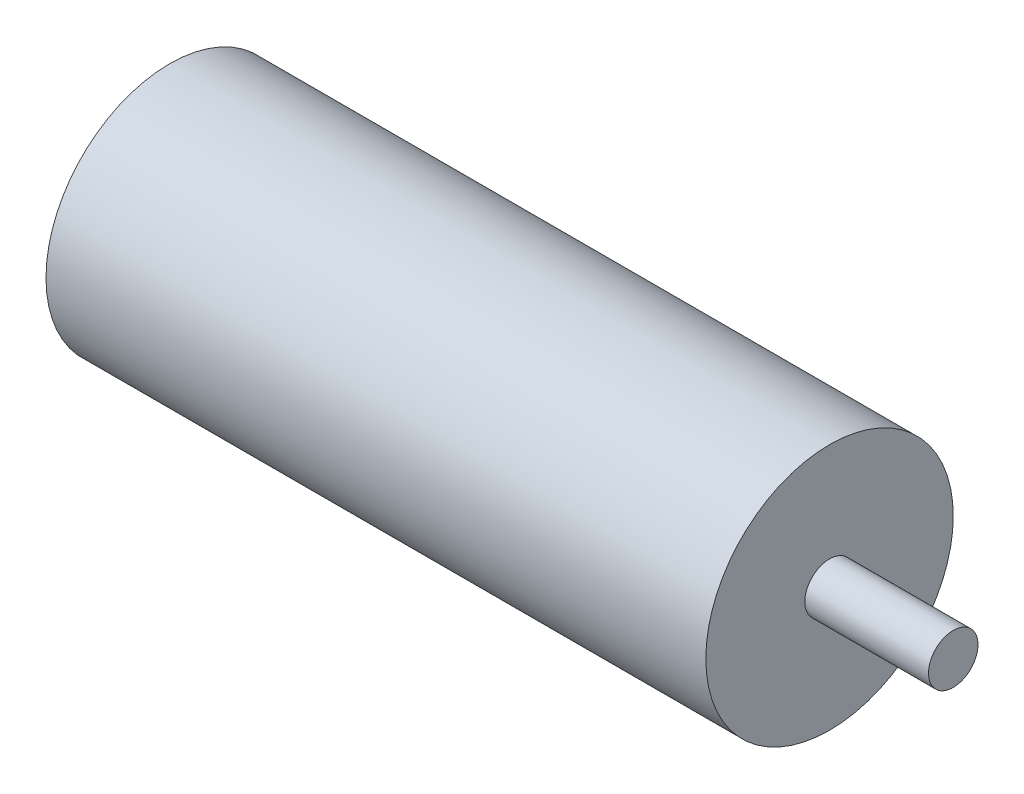
ISO-10303-21;
HEADER;
FILE_DESCRIPTION(('STEP AP214'),'2;1');
FILE_NAME('part.step','',(''),(''),'','','');
FILE_SCHEMA(('AUTOMOTIVE_DESIGN { 1 0 10303 214 1 1 1 1 }'));
ENDSEC;
DATA;
#1=APPLICATION_CONTEXT('core data for automotive mechanical design processes');
#2=APPLICATION_PROTOCOL_DEFINITION('international standard','automotive_design',2000,#1);
#3=PRODUCT_CONTEXT('',#1,'mechanical');
#4=PRODUCT('Part','Part','',(#3));
#5=PRODUCT_RELATED_PRODUCT_CATEGORY('part','',(#4));
#6=PRODUCT_DEFINITION_FORMATION('','',#4);
#7=PRODUCT_DEFINITION_CONTEXT('part definition',#1,'design');
#8=PRODUCT_DEFINITION('design','',#6,#7);
#9=PRODUCT_DEFINITION_SHAPE('','',#8);
#10=(LENGTH_UNIT() NAMED_UNIT(*) SI_UNIT(.MILLI.,.METRE.));
#11=(NAMED_UNIT(*) PLANE_ANGLE_UNIT() SI_UNIT($,.RADIAN.));
#12=(NAMED_UNIT(*) SI_UNIT($,.STERADIAN.) SOLID_ANGLE_UNIT());
#13=UNCERTAINTY_MEASURE_WITH_UNIT(LENGTH_MEASURE(1.E-05),#10,'distance_accuracy_value','');
#14=(GEOMETRIC_REPRESENTATION_CONTEXT(3) GLOBAL_UNCERTAINTY_ASSIGNED_CONTEXT((#13)) GLOBAL_UNIT_ASSIGNED_CONTEXT((#10,
#11,#12)) REPRESENTATION_CONTEXT('',''));
#15=CARTESIAN_POINT('',(0.,0.,0.));
#16=DIRECTION('',(0.,0.,1.));
#17=DIRECTION('',(1.,0.,0.));
#18=AXIS2_PLACEMENT_3D('',#15,#16,#17);
#19=CARTESIAN_POINT('',(45.,20.0994365209795,35.8177268345798));
#20=DIRECTION('',(-1.,0.,0.));
#21=DIRECTION('',(0.,0.,1.));
#22=AXIS2_PLACEMENT_3D('',#19,#20,#21);
#23=CYLINDRICAL_SURFACE('',#22,7.5);
#24=CARTESIAN_POINT('',(45.,20.0994365209795,35.8177268345798));
#25=DIRECTION('',(1.,0.,0.));
#26=DIRECTION('',(0.,0.,-1.));
#27=AXIS2_PLACEMENT_3D('',#24,#25,#26);
#28=CIRCLE('',#27,7.5);
#29=CARTESIAN_POINT('',(45.,20.0994365209795,28.3177268345798));
#30=VERTEX_POINT('',#29);
#31=EDGE_CURVE('E10',#30,#30,#28,.T.);
#32=ORIENTED_EDGE('',*,*,#31,.F.);
#33=EDGE_LOOP('',(#32));
#34=FACE_BOUND('',#33,.T.);
#35=CARTESIAN_POINT('',(5.,20.0994365209795,35.8177268345798));
#36=DIRECTION('',(-1.,0.,0.));
#37=DIRECTION('',(0.,0.,1.));
#38=AXIS2_PLACEMENT_3D('',#35,#36,#37);
#39=CIRCLE('',#38,7.5);
#40=CARTESIAN_POINT('',(5.,20.0994365209795,43.3177268345798));
#41=VERTEX_POINT('',#40);
#42=EDGE_CURVE('E35',#41,#41,#39,.T.);
#43=ORIENTED_EDGE('',*,*,#42,.F.);
#44=EDGE_LOOP('',(#43));
#45=FACE_BOUND('',#44,.T.);
#46=ADVANCED_FACE('F32',(#34,#45),#23,.T.);
#47=CARTESIAN_POINT('',(60.,20.0994365209795,35.8177268345798));
#48=DIRECTION('',(-1.,0.,0.));
#49=DIRECTION('',(0.,0.,1.));
#50=AXIS2_PLACEMENT_3D('',#47,#48,#49);
#51=CYLINDRICAL_SURFACE('',#50,1.5);
#52=CARTESIAN_POINT('',(45.,20.0994365209795,35.8177268345798));
#53=DIRECTION('',(1.,0.,0.));
#54=DIRECTION('',(0.,0.,-1.));
#55=AXIS2_PLACEMENT_3D('',#52,#53,#54);
#56=CIRCLE('',#55,1.5);
#57=CARTESIAN_POINT('',(45.,20.0994365209795,34.3177268345798));
#58=VERTEX_POINT('',#57);
#59=EDGE_CURVE('E39',#58,#58,#56,.T.);
#60=ORIENTED_EDGE('',*,*,#59,.T.);
#61=EDGE_LOOP('',(#60));
#62=FACE_BOUND('',#61,.T.);
#63=CARTESIAN_POINT('',(52.5,20.0994365209795,35.8177268345798));
#64=DIRECTION('',(1.,0.,0.));
#65=DIRECTION('',(0.,0.,-1.));
#66=AXIS2_PLACEMENT_3D('',#63,#64,#65);
#67=CIRCLE('',#66,1.5);
#68=CARTESIAN_POINT('',(52.5,20.0994365209795,34.3177268345798));
#69=VERTEX_POINT('',#68);
#70=EDGE_CURVE('E44',#69,#69,#67,.T.);
#71=ORIENTED_EDGE('',*,*,#70,.F.);
#72=EDGE_LOOP('',(#71));
#73=FACE_BOUND('',#72,.T.);
#74=ADVANCED_FACE('F55',(#62,#73),#51,.T.);
#75=CARTESIAN_POINT('',(45.,20.0994365209795,35.8177268345798));
#76=DIRECTION('',(1.,0.,0.));
#77=DIRECTION('',(0.,0.,-1.));
#78=AXIS2_PLACEMENT_3D('',#75,#76,#77);
#79=PLANE('',#78);
#80=ORIENTED_EDGE('',*,*,#31,.T.);
#81=EDGE_LOOP('',(#80));
#82=FACE_BOUND('',#81,.T.);
#83=ORIENTED_EDGE('',*,*,#59,.F.);
#84=EDGE_LOOP('',(#83));
#85=FACE_BOUND('',#84,.T.);
#86=ADVANCED_FACE('F60',(#82,#85),#79,.T.);
#87=CARTESIAN_POINT('',(52.5,20.1497502741006,35.7612098415387));
#88=DIRECTION('',(1.,0.,0.));
#89=DIRECTION('',(0.,0.,-1.));
#90=AXIS2_PLACEMENT_3D('',#87,#88,#89);
#91=PLANE('',#90);
#92=ORIENTED_EDGE('',*,*,#70,.T.);
#93=EDGE_LOOP('',(#92));
#94=FACE_BOUND('',#93,.T.);
#95=ADVANCED_FACE('F66',(#94),#91,.T.);
#96=CARTESIAN_POINT('',(5.,19.4638400084699,34.8496964616061));
#97=DIRECTION('',(-1.,0.,0.));
#98=DIRECTION('',(0.,0.,1.));
#99=AXIS2_PLACEMENT_3D('',#96,#97,#98);
#100=PLANE('',#99);
#101=ORIENTED_EDGE('',*,*,#42,.T.);
#102=EDGE_LOOP('',(#101));
#103=FACE_BOUND('',#102,.T.);
#104=ADVANCED_FACE('F52',(#103),#100,.T.);
#105=CLOSED_SHELL('',(#46,#74,#86,#95,#104));
#106=MANIFOLD_SOLID_BREP('B2',#105);
#107=ADVANCED_BREP_SHAPE_REPRESENTATION('',(#18,#106),#14);
#108=SHAPE_DEFINITION_REPRESENTATION(#9,#107);
ENDSEC;
END-ISO-10303-21;
